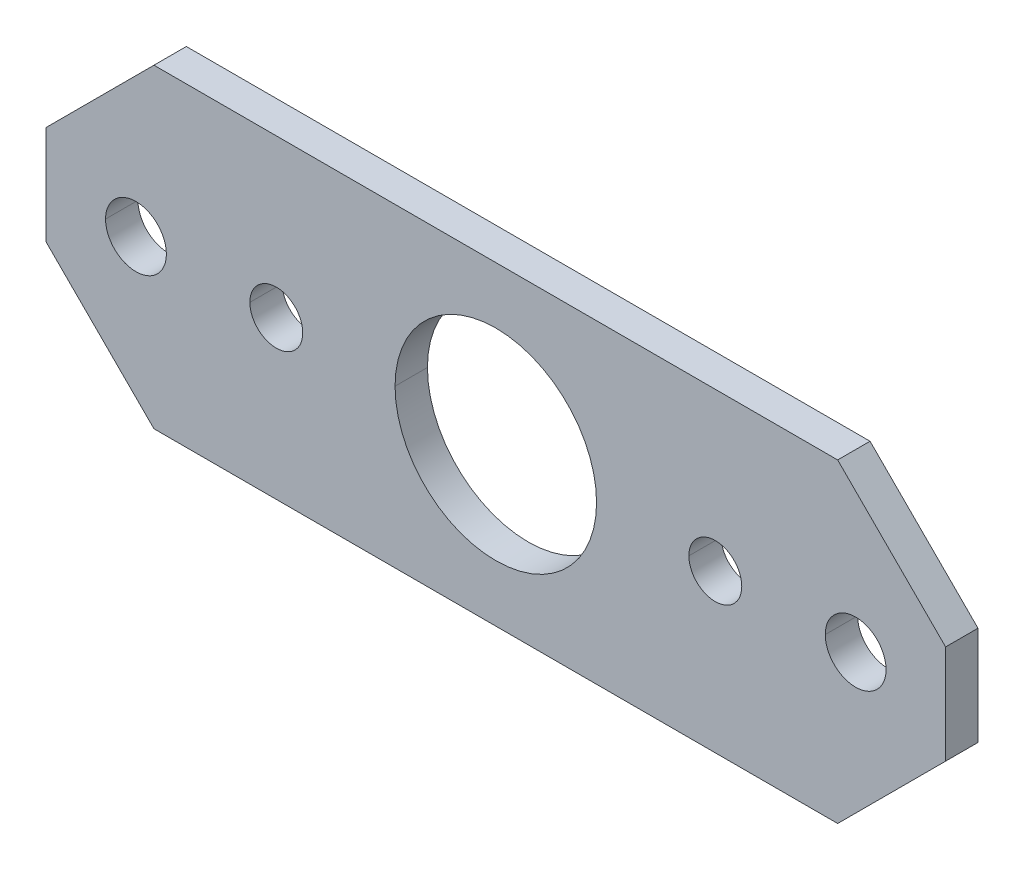
ISO-10303-21;
HEADER;
FILE_DESCRIPTION(('STEP AP214'),'2;1');
FILE_NAME('part.step','',(''),(''),'','','');
FILE_SCHEMA(('AUTOMOTIVE_DESIGN { 1 0 10303 214 1 1 1 1 }'));
ENDSEC;
DATA;
#1=APPLICATION_CONTEXT('core data for automotive mechanical design processes');
#2=APPLICATION_PROTOCOL_DEFINITION('international standard','automotive_design',2000,#1);
#3=PRODUCT_CONTEXT('',#1,'mechanical');
#4=PRODUCT('Part','Part','',(#3));
#5=PRODUCT_RELATED_PRODUCT_CATEGORY('part','',(#4));
#6=PRODUCT_DEFINITION_FORMATION('','',#4);
#7=PRODUCT_DEFINITION_CONTEXT('part definition',#1,'design');
#8=PRODUCT_DEFINITION('design','',#6,#7);
#9=PRODUCT_DEFINITION_SHAPE('','',#8);
#10=(LENGTH_UNIT() NAMED_UNIT(*) SI_UNIT(.MILLI.,.METRE.));
#11=(NAMED_UNIT(*) PLANE_ANGLE_UNIT() SI_UNIT($,.RADIAN.));
#12=(NAMED_UNIT(*) SI_UNIT($,.STERADIAN.) SOLID_ANGLE_UNIT());
#13=UNCERTAINTY_MEASURE_WITH_UNIT(LENGTH_MEASURE(1.E-05),#10,'distance_accuracy_value','');
#14=(GEOMETRIC_REPRESENTATION_CONTEXT(3) GLOBAL_UNCERTAINTY_ASSIGNED_CONTEXT((#13)) GLOBAL_UNIT_ASSIGNED_CONTEXT((#10,
#11,#12)) REPRESENTATION_CONTEXT('',''));
#15=CARTESIAN_POINT('',(0.,0.,0.));
#16=DIRECTION('',(0.,0.,1.));
#17=DIRECTION('',(1.,0.,0.));
#18=AXIS2_PLACEMENT_3D('',#15,#16,#17);
#19=CARTESIAN_POINT('',(-15.494,0.,2.286));
#20=DIRECTION('',(0.,0.,-1.));
#21=DIRECTION('',(-1.,0.,0.));
#22=AXIS2_PLACEMENT_3D('',#19,#20,#21);
#23=CYLINDRICAL_SURFACE('',#22,1.8669);
#24=CARTESIAN_POINT('',(-15.494,0.,2.286));
#25=DIRECTION('',(0.,0.,-1.));
#26=DIRECTION('',(-1.,0.,0.));
#27=AXIS2_PLACEMENT_3D('',#24,#25,#26);
#28=CIRCLE('',#27,1.8669);
#29=CARTESIAN_POINT('',(-13.6271,0.,2.286));
#30=VERTEX_POINT('',#29);
#31=CARTESIAN_POINT('',(-17.3609,0.,2.286));
#32=VERTEX_POINT('',#31);
#33=EDGE_CURVE('E40',#30,#32,#28,.T.);
#34=ORIENTED_EDGE('',*,*,#33,.F.);
#35=DIRECTION('',(0.,0.,-1.));
#36=VECTOR('',#35,1.);
#37=CARTESIAN_POINT('',(-13.6271,0.,2.286));
#38=LINE('',#37,#36);
#39=CARTESIAN_POINT('',(-13.6271,0.,0.));
#40=VERTEX_POINT('',#39);
#41=EDGE_CURVE('E11',#30,#40,#38,.T.);
#42=ORIENTED_EDGE('',*,*,#41,.T.);
#43=CARTESIAN_POINT('',(-15.494,0.,0.));
#44=DIRECTION('',(0.,0.,-1.));
#45=DIRECTION('',(-1.,0.,0.));
#46=AXIS2_PLACEMENT_3D('',#43,#44,#45);
#47=CIRCLE('',#46,1.8669);
#48=CARTESIAN_POINT('',(-17.3609,0.,0.));
#49=VERTEX_POINT('',#48);
#50=EDGE_CURVE('E27',#40,#49,#47,.T.);
#51=ORIENTED_EDGE('',*,*,#50,.T.);
#52=DIRECTION('',(0.,0.,-1.));
#53=VECTOR('',#52,1.);
#54=CARTESIAN_POINT('',(-17.3609,0.,2.286));
#55=LINE('',#54,#53);
#56=EDGE_CURVE('E20',#32,#49,#55,.T.);
#57=ORIENTED_EDGE('',*,*,#56,.F.);
#58=EDGE_LOOP('',(#34,#42,#51,#57));
#59=FACE_BOUND('',#58,.T.);
#60=ADVANCED_FACE('F16',(#59),#23,.F.);
#61=CARTESIAN_POINT('',(15.494,0.,2.286));
#62=DIRECTION('',(0.,0.,-1.));
#63=DIRECTION('',(-1.,0.,0.));
#64=AXIS2_PLACEMENT_3D('',#61,#62,#63);
#65=CYLINDRICAL_SURFACE('',#64,1.8669);
#66=CARTESIAN_POINT('',(15.494,0.,2.286));
#67=DIRECTION('',(0.,0.,-1.));
#68=DIRECTION('',(-1.,0.,0.));
#69=AXIS2_PLACEMENT_3D('',#66,#67,#68);
#70=CIRCLE('',#69,1.8669);
#71=CARTESIAN_POINT('',(17.3609,0.,2.286));
#72=VERTEX_POINT('',#71);
#73=CARTESIAN_POINT('',(13.6271,0.,2.286));
#74=VERTEX_POINT('',#73);
#75=EDGE_CURVE('E206',#72,#74,#70,.T.);
#76=ORIENTED_EDGE('',*,*,#75,.F.);
#77=DIRECTION('',(0.,0.,-1.));
#78=VECTOR('',#77,1.);
#79=CARTESIAN_POINT('',(17.3609,0.,2.286));
#80=LINE('',#79,#78);
#81=CARTESIAN_POINT('',(17.3609,0.,0.));
#82=VERTEX_POINT('',#81);
#83=EDGE_CURVE('E321',#72,#82,#80,.T.);
#84=ORIENTED_EDGE('',*,*,#83,.T.);
#85=CARTESIAN_POINT('',(15.494,0.,0.));
#86=DIRECTION('',(0.,0.,-1.));
#87=DIRECTION('',(-1.,0.,0.));
#88=AXIS2_PLACEMENT_3D('',#85,#86,#87);
#89=CIRCLE('',#88,1.8669);
#90=CARTESIAN_POINT('',(13.6271,0.,0.));
#91=VERTEX_POINT('',#90);
#92=EDGE_CURVE('E200',#82,#91,#89,.T.);
#93=ORIENTED_EDGE('',*,*,#92,.T.);
#94=DIRECTION('',(0.,0.,-1.));
#95=VECTOR('',#94,1.);
#96=CARTESIAN_POINT('',(13.6271,0.,2.286));
#97=LINE('',#96,#95);
#98=EDGE_CURVE('E356',#74,#91,#97,.T.);
#99=ORIENTED_EDGE('',*,*,#98,.F.);
#100=EDGE_LOOP('',(#76,#84,#93,#99));
#101=FACE_BOUND('',#100,.T.);
#102=ADVANCED_FACE('F429',(#101),#65,.F.);
#103=CARTESIAN_POINT('',(-25.4,0.,2.286));
#104=DIRECTION('',(0.,0.,-1.));
#105=DIRECTION('',(-1.,0.,0.));
#106=AXIS2_PLACEMENT_3D('',#103,#104,#105);
#107=CYLINDRICAL_SURFACE('',#106,2.1463);
#108=CARTESIAN_POINT('',(-25.4,0.,2.286));
#109=DIRECTION('',(0.,0.,-1.));
#110=DIRECTION('',(-1.,0.,0.));
#111=AXIS2_PLACEMENT_3D('',#108,#109,#110);
#112=CIRCLE('',#111,2.1463);
#113=CARTESIAN_POINT('',(-23.2537,0.,2.286));
#114=VERTEX_POINT('',#113);
#115=CARTESIAN_POINT('',(-27.5463,0.,2.286));
#116=VERTEX_POINT('',#115);
#117=EDGE_CURVE('E181',#114,#116,#112,.T.);
#118=ORIENTED_EDGE('',*,*,#117,.F.);
#119=DIRECTION('',(0.,0.,-1.));
#120=VECTOR('',#119,1.);
#121=CARTESIAN_POINT('',(-23.2537,0.,2.286));
#122=LINE('',#121,#120);
#123=CARTESIAN_POINT('',(-23.2537,0.,0.));
#124=VERTEX_POINT('',#123);
#125=EDGE_CURVE('E185',#114,#124,#122,.T.);
#126=ORIENTED_EDGE('',*,*,#125,.T.);
#127=CARTESIAN_POINT('',(-25.4,0.,0.));
#128=DIRECTION('',(0.,0.,-1.));
#129=DIRECTION('',(-1.,0.,0.));
#130=AXIS2_PLACEMENT_3D('',#127,#128,#129);
#131=CIRCLE('',#130,2.1463);
#132=CARTESIAN_POINT('',(-27.5463,0.,0.));
#133=VERTEX_POINT('',#132);
#134=EDGE_CURVE('E201',#124,#133,#131,.T.);
#135=ORIENTED_EDGE('',*,*,#134,.T.);
#136=DIRECTION('',(0.,0.,-1.));
#137=VECTOR('',#136,1.);
#138=CARTESIAN_POINT('',(-27.5463,0.,2.286));
#139=LINE('',#138,#137);
#140=EDGE_CURVE('E187',#116,#133,#139,.T.);
#141=ORIENTED_EDGE('',*,*,#140,.F.);
#142=EDGE_LOOP('',(#118,#126,#135,#141));
#143=FACE_BOUND('',#142,.T.);
#144=ADVANCED_FACE('F183',(#143),#107,.F.);
#145=CARTESIAN_POINT('',(25.4,0.,2.286));
#146=DIRECTION('',(0.,0.,-1.));
#147=DIRECTION('',(-1.,0.,0.));
#148=AXIS2_PLACEMENT_3D('',#145,#146,#147);
#149=CYLINDRICAL_SURFACE('',#148,2.1463);
#150=CARTESIAN_POINT('',(25.4,0.,2.286));
#151=DIRECTION('',(0.,0.,-1.));
#152=DIRECTION('',(-1.,0.,0.));
#153=AXIS2_PLACEMENT_3D('',#150,#151,#152);
#154=CIRCLE('',#153,2.1463);
#155=CARTESIAN_POINT('',(27.5463,0.,2.286));
#156=VERTEX_POINT('',#155);
#157=CARTESIAN_POINT('',(23.2537,0.,2.286));
#158=VERTEX_POINT('',#157);
#159=EDGE_CURVE('E334',#156,#158,#154,.T.);
#160=ORIENTED_EDGE('',*,*,#159,.F.);
#161=DIRECTION('',(0.,0.,-1.));
#162=VECTOR('',#161,1.);
#163=CARTESIAN_POINT('',(27.5463,0.,2.286));
#164=LINE('',#163,#162);
#165=CARTESIAN_POINT('',(27.5463,0.,0.));
#166=VERTEX_POINT('',#165);
#167=EDGE_CURVE('E296',#156,#166,#164,.T.);
#168=ORIENTED_EDGE('',*,*,#167,.T.);
#169=CARTESIAN_POINT('',(25.4,0.,0.));
#170=DIRECTION('',(0.,0.,-1.));
#171=DIRECTION('',(-1.,0.,0.));
#172=AXIS2_PLACEMENT_3D('',#169,#170,#171);
#173=CIRCLE('',#172,2.1463);
#174=CARTESIAN_POINT('',(23.2537,0.,0.));
#175=VERTEX_POINT('',#174);
#176=EDGE_CURVE('E241',#166,#175,#173,.T.);
#177=ORIENTED_EDGE('',*,*,#176,.T.);
#178=DIRECTION('',(0.,0.,-1.));
#179=VECTOR('',#178,1.);
#180=CARTESIAN_POINT('',(23.2537,0.,2.286));
#181=LINE('',#180,#179);
#182=EDGE_CURVE('E285',#158,#175,#181,.T.);
#183=ORIENTED_EDGE('',*,*,#182,.F.);
#184=EDGE_LOOP('',(#160,#168,#177,#183));
#185=FACE_BOUND('',#184,.T.);
#186=ADVANCED_FACE('F437',(#185),#149,.F.);
#187=CARTESIAN_POINT('',(0.,0.,2.286));
#188=DIRECTION('',(0.,0.,-1.));
#189=DIRECTION('',(-1.,0.,0.));
#190=AXIS2_PLACEMENT_3D('',#187,#188,#189);
#191=CYLINDRICAL_SURFACE('',#190,7.112);
#192=CARTESIAN_POINT('',(0.,0.,2.286));
#193=DIRECTION('',(0.,0.,-1.));
#194=DIRECTION('',(-1.,0.,0.));
#195=AXIS2_PLACEMENT_3D('',#192,#193,#194);
#196=CIRCLE('',#195,7.112);
#197=CARTESIAN_POINT('',(7.112,0.,2.286));
#198=VERTEX_POINT('',#197);
#199=CARTESIAN_POINT('',(-7.112,0.,2.286));
#200=VERTEX_POINT('',#199);
#201=EDGE_CURVE('E335',#198,#200,#196,.T.);
#202=ORIENTED_EDGE('',*,*,#201,.F.);
#203=DIRECTION('',(0.,0.,-1.));
#204=VECTOR('',#203,1.);
#205=CARTESIAN_POINT('',(7.112,0.,2.286));
#206=LINE('',#205,#204);
#207=CARTESIAN_POINT('',(7.112,0.,0.));
#208=VERTEX_POINT('',#207);
#209=EDGE_CURVE('E233',#198,#208,#206,.T.);
#210=ORIENTED_EDGE('',*,*,#209,.T.);
#211=CARTESIAN_POINT('',(0.,0.,0.));
#212=DIRECTION('',(0.,0.,-1.));
#213=DIRECTION('',(-1.,0.,0.));
#214=AXIS2_PLACEMENT_3D('',#211,#212,#213);
#215=CIRCLE('',#214,7.112);
#216=CARTESIAN_POINT('',(-7.112,0.,0.));
#217=VERTEX_POINT('',#216);
#218=EDGE_CURVE('E230',#208,#217,#215,.T.);
#219=ORIENTED_EDGE('',*,*,#218,.T.);
#220=DIRECTION('',(0.,0.,-1.));
#221=VECTOR('',#220,1.);
#222=CARTESIAN_POINT('',(-7.112,0.,2.286));
#223=LINE('',#222,#221);
#224=EDGE_CURVE('E286',#200,#217,#223,.T.);
#225=ORIENTED_EDGE('',*,*,#224,.F.);
#226=EDGE_LOOP('',(#202,#210,#219,#225));
#227=FACE_BOUND('',#226,.T.);
#228=ADVANCED_FACE('F409',(#227),#191,.F.);
#229=CARTESIAN_POINT('',(-31.75,11.1125,2.286));
#230=DIRECTION('',(1.,0.,0.));
#231=DIRECTION('',(0.,1.,0.));
#232=AXIS2_PLACEMENT_3D('',#229,#230,#231);
#233=PLANE('',#232);
#234=DIRECTION('',(0.,-1.,0.));
#235=VECTOR('',#234,1.);
#236=CARTESIAN_POINT('',(-31.75,11.1125,0.));
#237=LINE('',#236,#235);
#238=CARTESIAN_POINT('',(-31.75,3.4925,0.));
#239=VERTEX_POINT('',#238);
#240=CARTESIAN_POINT('',(-31.75,-3.4925,0.));
#241=VERTEX_POINT('',#240);
#242=EDGE_CURVE('E223',#239,#241,#237,.T.);
#243=ORIENTED_EDGE('',*,*,#242,.T.);
#244=DIRECTION('',(0.,0.,1.));
#245=VECTOR('',#244,1.);
#246=CARTESIAN_POINT('',(-31.75,-3.4925,2.286));
#247=LINE('',#246,#245);
#248=CARTESIAN_POINT('',(-31.75,-3.4925,2.286));
#249=VERTEX_POINT('',#248);
#250=EDGE_CURVE('E220',#241,#249,#247,.T.);
#251=ORIENTED_EDGE('',*,*,#250,.T.);
#252=DIRECTION('',(0.,-1.,0.));
#253=VECTOR('',#252,1.);
#254=CARTESIAN_POINT('',(-31.75,11.1125,2.286));
#255=LINE('',#254,#253);
#256=CARTESIAN_POINT('',(-31.75,3.4925,2.286));
#257=VERTEX_POINT('',#256);
#258=EDGE_CURVE('E228',#257,#249,#255,.T.);
#259=ORIENTED_EDGE('',*,*,#258,.F.);
#260=DIRECTION('',(0.,0.,-1.));
#261=VECTOR('',#260,1.);
#262=CARTESIAN_POINT('',(-31.75,3.4925,2.286));
#263=LINE('',#262,#261);
#264=EDGE_CURVE('E224',#257,#239,#263,.T.);
#265=ORIENTED_EDGE('',*,*,#264,.T.);
#266=EDGE_LOOP('',(#243,#251,#259,#265));
#267=FACE_BOUND('',#266,.T.);
#268=ADVANCED_FACE('F564',(#267),#233,.F.);
#269=CARTESIAN_POINT('',(-31.75,-11.1125,2.286));
#270=DIRECTION('',(0.,1.,0.));
#271=DIRECTION('',(1.,0.,0.));
#272=AXIS2_PLACEMENT_3D('',#269,#270,#271);
#273=PLANE('',#272);
#274=DIRECTION('',(1.,0.,0.));
#275=VECTOR('',#274,1.);
#276=CARTESIAN_POINT('',(-31.75,-11.1125,2.286));
#277=LINE('',#276,#275);
#278=CARTESIAN_POINT('',(-24.13,-11.1125,2.286));
#279=VERTEX_POINT('',#278);
#280=CARTESIAN_POINT('',(24.13,-11.1125,2.286));
#281=VERTEX_POINT('',#280);
#282=EDGE_CURVE('E229',#279,#281,#277,.T.);
#283=ORIENTED_EDGE('',*,*,#282,.F.);
#284=DIRECTION('',(0.,0.,-1.));
#285=VECTOR('',#284,1.);
#286=CARTESIAN_POINT('',(-24.13,-11.1125,2.286));
#287=LINE('',#286,#285);
#288=CARTESIAN_POINT('',(-24.13,-11.1125,0.));
#289=VERTEX_POINT('',#288);
#290=EDGE_CURVE('E322',#279,#289,#287,.T.);
#291=ORIENTED_EDGE('',*,*,#290,.T.);
#292=DIRECTION('',(1.,0.,0.));
#293=VECTOR('',#292,1.);
#294=CARTESIAN_POINT('',(-31.75,-11.1125,0.));
#295=LINE('',#294,#293);
#296=CARTESIAN_POINT('',(24.13,-11.1125,0.));
#297=VERTEX_POINT('',#296);
#298=EDGE_CURVE('E326',#289,#297,#295,.T.);
#299=ORIENTED_EDGE('',*,*,#298,.T.);
#300=DIRECTION('',(0.,0.,1.));
#301=VECTOR('',#300,1.);
#302=CARTESIAN_POINT('',(24.13,-11.1125,2.286));
#303=LINE('',#302,#301);
#304=EDGE_CURVE('E275',#297,#281,#303,.T.);
#305=ORIENTED_EDGE('',*,*,#304,.T.);
#306=EDGE_LOOP('',(#283,#291,#299,#305));
#307=FACE_BOUND('',#306,.T.);
#308=ADVANCED_FACE('F479',(#307),#273,.F.);
#309=CARTESIAN_POINT('',(31.75,11.1125,2.286));
#310=DIRECTION('',(-1.,0.,0.));
#311=DIRECTION('',(0.,0.,1.));
#312=AXIS2_PLACEMENT_3D('',#309,#310,#311);
#313=PLANE('',#312);
#314=DIRECTION('',(0.,1.,0.));
#315=VECTOR('',#314,1.);
#316=CARTESIAN_POINT('',(31.75,11.1125,2.286));
#317=LINE('',#316,#315);
#318=CARTESIAN_POINT('',(31.75,-3.4925,2.286));
#319=VERTEX_POINT('',#318);
#320=CARTESIAN_POINT('',(31.75,3.4925,2.286));
#321=VERTEX_POINT('',#320);
#322=EDGE_CURVE('E266',#319,#321,#317,.T.);
#323=ORIENTED_EDGE('',*,*,#322,.F.);
#324=DIRECTION('',(0.,0.,-1.));
#325=VECTOR('',#324,1.);
#326=CARTESIAN_POINT('',(31.75,-3.4925,2.286));
#327=LINE('',#326,#325);
#328=CARTESIAN_POINT('',(31.75,-3.4925,0.));
#329=VERTEX_POINT('',#328);
#330=EDGE_CURVE('E271',#319,#329,#327,.T.);
#331=ORIENTED_EDGE('',*,*,#330,.T.);
#332=DIRECTION('',(0.,1.,0.));
#333=VECTOR('',#332,1.);
#334=CARTESIAN_POINT('',(31.75,11.1125,0.));
#335=LINE('',#334,#333);
#336=CARTESIAN_POINT('',(31.75,3.4925,0.));
#337=VERTEX_POINT('',#336);
#338=EDGE_CURVE('E218',#329,#337,#335,.T.);
#339=ORIENTED_EDGE('',*,*,#338,.T.);
#340=DIRECTION('',(0.,0.,1.));
#341=VECTOR('',#340,1.);
#342=CARTESIAN_POINT('',(31.75,3.4925,2.286));
#343=LINE('',#342,#341);
#344=EDGE_CURVE('E258',#337,#321,#343,.T.);
#345=ORIENTED_EDGE('',*,*,#344,.T.);
#346=EDGE_LOOP('',(#323,#331,#339,#345));
#347=FACE_BOUND('',#346,.T.);
#348=ADVANCED_FACE('F422',(#347),#313,.F.);
#349=CARTESIAN_POINT('',(-31.75,11.1125,2.286));
#350=DIRECTION('',(0.,-1.,0.));
#351=DIRECTION('',(0.,0.,-1.));
#352=AXIS2_PLACEMENT_3D('',#349,#350,#351);
#353=PLANE('',#352);
#354=DIRECTION('',(-1.,0.,0.));
#355=VECTOR('',#354,1.);
#356=CARTESIAN_POINT('',(-31.75,11.1125,2.286));
#357=LINE('',#356,#355);
#358=CARTESIAN_POINT('',(24.13,11.1125,2.286));
#359=VERTEX_POINT('',#358);
#360=CARTESIAN_POINT('',(-24.13,11.1125,2.286));
#361=VERTEX_POINT('',#360);
#362=EDGE_CURVE('E280',#359,#361,#357,.T.);
#363=ORIENTED_EDGE('',*,*,#362,.F.);
#364=DIRECTION('',(0.,0.,-1.));
#365=VECTOR('',#364,1.);
#366=CARTESIAN_POINT('',(24.13,11.1125,2.286));
#367=LINE('',#366,#365);
#368=CARTESIAN_POINT('',(24.13,11.1125,0.));
#369=VERTEX_POINT('',#368);
#370=EDGE_CURVE('E261',#359,#369,#367,.T.);
#371=ORIENTED_EDGE('',*,*,#370,.T.);
#372=DIRECTION('',(-1.,0.,0.));
#373=VECTOR('',#372,1.);
#374=CARTESIAN_POINT('',(-31.75,11.1125,0.));
#375=LINE('',#374,#373);
#376=CARTESIAN_POINT('',(-24.13,11.1125,0.));
#377=VERTEX_POINT('',#376);
#378=EDGE_CURVE('E339',#369,#377,#375,.T.);
#379=ORIENTED_EDGE('',*,*,#378,.T.);
#380=DIRECTION('',(0.,0.,1.));
#381=VECTOR('',#380,1.);
#382=CARTESIAN_POINT('',(-24.13,11.1125,2.286));
#383=LINE('',#382,#381);
#384=EDGE_CURVE('E350',#377,#361,#383,.T.);
#385=ORIENTED_EDGE('',*,*,#384,.T.);
#386=EDGE_LOOP('',(#363,#371,#379,#385));
#387=FACE_BOUND('',#386,.T.);
#388=ADVANCED_FACE('F412',(#387),#353,.F.);
#389=CARTESIAN_POINT('',(-31.75,-11.1125,2.286));
#390=DIRECTION('',(0.,0.,1.));
#391=DIRECTION('',(1.,0.,0.));
#392=AXIS2_PLACEMENT_3D('',#389,#390,#391);
#393=PLANE('',#392);
#394=ORIENTED_EDGE('',*,*,#258,.T.);
#395=DIRECTION('',(0.707106781186548,-0.707106781186548,0.));
#396=VECTOR('',#395,1.);
#397=CARTESIAN_POINT('',(-27.94,-7.3025,2.286));
#398=LINE('',#397,#396);
#399=EDGE_CURVE('E225',#249,#279,#398,.T.);
#400=ORIENTED_EDGE('',*,*,#399,.T.);
#401=ORIENTED_EDGE('',*,*,#282,.T.);
#402=DIRECTION('',(0.707106781186548,0.707106781186547,0.));
#403=VECTOR('',#402,1.);
#404=CARTESIAN_POINT('',(-3.81,-39.0525,2.286));
#405=LINE('',#404,#403);
#406=EDGE_CURVE('E262',#281,#319,#405,.T.);
#407=ORIENTED_EDGE('',*,*,#406,.T.);
#408=ORIENTED_EDGE('',*,*,#322,.T.);
#409=DIRECTION('',(-0.707106781186548,0.707106781186548,0.));
#410=VECTOR('',#409,1.);
#411=CARTESIAN_POINT('',(7.3025,27.94,2.286));
#412=LINE('',#411,#410);
#413=EDGE_CURVE('E276',#321,#359,#412,.T.);
#414=ORIENTED_EDGE('',*,*,#413,.T.);
#415=ORIENTED_EDGE('',*,*,#362,.T.);
#416=DIRECTION('',(-0.707106781186548,-0.707106781186548,0.));
#417=VECTOR('',#416,1.);
#418=CARTESIAN_POINT('',(-39.0525,-3.81,2.286));
#419=LINE('',#418,#417);
#420=EDGE_CURVE('E342',#361,#257,#419,.T.);
#421=ORIENTED_EDGE('',*,*,#420,.T.);
#422=EDGE_LOOP('',(#394,#400,#401,#407,#408,#414,#415,#421));
#423=FACE_BOUND('',#422,.T.);
#424=CARTESIAN_POINT('',(-15.494,0.,2.286));
#425=DIRECTION('',(0.,0.,-1.));
#426=DIRECTION('',(-1.,0.,0.));
#427=AXIS2_PLACEMENT_3D('',#424,#425,#426);
#428=CIRCLE('',#427,1.8669);
#429=EDGE_CURVE('E386',#32,#30,#428,.T.);
#430=ORIENTED_EDGE('',*,*,#429,.T.);
#431=ORIENTED_EDGE('',*,*,#33,.T.);
#432=EDGE_LOOP('',(#430,#431));
#433=FACE_BOUND('',#432,.T.);
#434=CARTESIAN_POINT('',(15.494,0.,2.286));
#435=DIRECTION('',(0.,0.,-1.));
#436=DIRECTION('',(-1.,0.,0.));
#437=AXIS2_PLACEMENT_3D('',#434,#435,#436);
#438=CIRCLE('',#437,1.8669);
#439=EDGE_CURVE('E214',#74,#72,#438,.T.);
#440=ORIENTED_EDGE('',*,*,#439,.T.);
#441=ORIENTED_EDGE('',*,*,#75,.T.);
#442=EDGE_LOOP('',(#440,#441));
#443=FACE_BOUND('',#442,.T.);
#444=CARTESIAN_POINT('',(-25.4,0.,2.286));
#445=DIRECTION('',(0.,0.,-1.));
#446=DIRECTION('',(-1.,0.,0.));
#447=AXIS2_PLACEMENT_3D('',#444,#445,#446);
#448=CIRCLE('',#447,2.1463);
#449=EDGE_CURVE('E192',#116,#114,#448,.T.);
#450=ORIENTED_EDGE('',*,*,#449,.T.);
#451=ORIENTED_EDGE('',*,*,#117,.T.);
#452=EDGE_LOOP('',(#450,#451));
#453=FACE_BOUND('',#452,.T.);
#454=CARTESIAN_POINT('',(25.4,0.,2.286));
#455=DIRECTION('',(0.,0.,-1.));
#456=DIRECTION('',(-1.,0.,0.));
#457=AXIS2_PLACEMENT_3D('',#454,#455,#456);
#458=CIRCLE('',#457,2.1463);
#459=EDGE_CURVE('E193',#158,#156,#458,.T.);
#460=ORIENTED_EDGE('',*,*,#459,.T.);
#461=ORIENTED_EDGE('',*,*,#159,.T.);
#462=EDGE_LOOP('',(#460,#461));
#463=FACE_BOUND('',#462,.T.);
#464=CARTESIAN_POINT('',(0.,0.,2.286));
#465=DIRECTION('',(0.,0.,-1.));
#466=DIRECTION('',(-1.,0.,0.));
#467=AXIS2_PLACEMENT_3D('',#464,#465,#466);
#468=CIRCLE('',#467,7.112);
#469=EDGE_CURVE('E330',#200,#198,#468,.T.);
#470=ORIENTED_EDGE('',*,*,#469,.T.);
#471=ORIENTED_EDGE('',*,*,#201,.T.);
#472=EDGE_LOOP('',(#470,#471));
#473=FACE_BOUND('',#472,.T.);
#474=ADVANCED_FACE('F203',(#423,#433,#443,#453,#463,#473),#393,.T.);
#475=CARTESIAN_POINT('',(-31.75,-11.1125,0.));
#476=DIRECTION('',(0.,0.,1.));
#477=DIRECTION('',(1.,0.,0.));
#478=AXIS2_PLACEMENT_3D('',#475,#476,#477);
#479=PLANE('',#478);
#480=ORIENTED_EDGE('',*,*,#298,.F.);
#481=DIRECTION('',(-0.707106781186548,0.707106781186548,0.));
#482=VECTOR('',#481,1.);
#483=CARTESIAN_POINT('',(-24.13,-11.1125,0.));
#484=LINE('',#483,#482);
#485=EDGE_CURVE('E293',#289,#241,#484,.T.);
#486=ORIENTED_EDGE('',*,*,#485,.T.);
#487=ORIENTED_EDGE('',*,*,#242,.F.);
#488=DIRECTION('',(0.707106781186548,0.707106781186548,0.));
#489=VECTOR('',#488,1.);
#490=CARTESIAN_POINT('',(-31.75,3.4925,0.));
#491=LINE('',#490,#489);
#492=EDGE_CURVE('E290',#239,#377,#491,.T.);
#493=ORIENTED_EDGE('',*,*,#492,.T.);
#494=ORIENTED_EDGE('',*,*,#378,.F.);
#495=DIRECTION('',(0.707106781186548,-0.707106781186548,0.));
#496=VECTOR('',#495,1.);
#497=CARTESIAN_POINT('',(24.13,11.1125,0.));
#498=LINE('',#497,#496);
#499=EDGE_CURVE('E294',#369,#337,#498,.T.);
#500=ORIENTED_EDGE('',*,*,#499,.T.);
#501=ORIENTED_EDGE('',*,*,#338,.F.);
#502=DIRECTION('',(-0.707106781186548,-0.707106781186547,0.));
#503=VECTOR('',#502,1.);
#504=CARTESIAN_POINT('',(31.75,-3.4925,0.));
#505=LINE('',#504,#503);
#506=EDGE_CURVE('E289',#329,#297,#505,.T.);
#507=ORIENTED_EDGE('',*,*,#506,.T.);
#508=EDGE_LOOP('',(#480,#486,#487,#493,#494,#500,#501,#507));
#509=FACE_BOUND('',#508,.T.);
#510=CARTESIAN_POINT('',(-15.494,0.,0.));
#511=DIRECTION('',(0.,0.,-1.));
#512=DIRECTION('',(-1.,0.,0.));
#513=AXIS2_PLACEMENT_3D('',#510,#511,#512);
#514=CIRCLE('',#513,1.8669);
#515=EDGE_CURVE('E267',#49,#40,#514,.T.);
#516=ORIENTED_EDGE('',*,*,#515,.F.);
#517=ORIENTED_EDGE('',*,*,#50,.F.);
#518=EDGE_LOOP('',(#516,#517));
#519=FACE_BOUND('',#518,.T.);
#520=CARTESIAN_POINT('',(15.494,0.,0.));
#521=DIRECTION('',(0.,0.,-1.));
#522=DIRECTION('',(-1.,0.,0.));
#523=AXIS2_PLACEMENT_3D('',#520,#521,#522);
#524=CIRCLE('',#523,1.8669);
#525=EDGE_CURVE('E358',#91,#82,#524,.T.);
#526=ORIENTED_EDGE('',*,*,#525,.F.);
#527=ORIENTED_EDGE('',*,*,#92,.F.);
#528=EDGE_LOOP('',(#526,#527));
#529=FACE_BOUND('',#528,.T.);
#530=CARTESIAN_POINT('',(-25.4,0.,0.));
#531=DIRECTION('',(0.,0.,-1.));
#532=DIRECTION('',(-1.,0.,0.));
#533=AXIS2_PLACEMENT_3D('',#530,#531,#532);
#534=CIRCLE('',#533,2.1463);
#535=EDGE_CURVE('E198',#133,#124,#534,.T.);
#536=ORIENTED_EDGE('',*,*,#535,.F.);
#537=ORIENTED_EDGE('',*,*,#134,.F.);
#538=EDGE_LOOP('',(#536,#537));
#539=FACE_BOUND('',#538,.T.);
#540=CARTESIAN_POINT('',(25.4,0.,0.));
#541=DIRECTION('',(0.,0.,-1.));
#542=DIRECTION('',(-1.,0.,0.));
#543=AXIS2_PLACEMENT_3D('',#540,#541,#542);
#544=CIRCLE('',#543,2.1463);
#545=EDGE_CURVE('E281',#175,#166,#544,.T.);
#546=ORIENTED_EDGE('',*,*,#545,.F.);
#547=ORIENTED_EDGE('',*,*,#176,.F.);
#548=EDGE_LOOP('',(#546,#547));
#549=FACE_BOUND('',#548,.T.);
#550=CARTESIAN_POINT('',(0.,0.,0.));
#551=DIRECTION('',(0.,0.,-1.));
#552=DIRECTION('',(-1.,0.,0.));
#553=AXIS2_PLACEMENT_3D('',#550,#551,#552);
#554=CIRCLE('',#553,7.112);
#555=EDGE_CURVE('E256',#217,#208,#554,.T.);
#556=ORIENTED_EDGE('',*,*,#555,.F.);
#557=ORIENTED_EDGE('',*,*,#218,.F.);
#558=EDGE_LOOP('',(#556,#557));
#559=FACE_BOUND('',#558,.T.);
#560=ADVANCED_FACE('F408',(#509,#519,#529,#539,#549,#559),#479,.F.);
#561=CARTESIAN_POINT('',(0.,0.,2.286));
#562=DIRECTION('',(0.,0.,-1.));
#563=DIRECTION('',(-1.,0.,0.));
#564=AXIS2_PLACEMENT_3D('',#561,#562,#563);
#565=CYLINDRICAL_SURFACE('',#564,7.112);
#566=ORIENTED_EDGE('',*,*,#209,.F.);
#567=ORIENTED_EDGE('',*,*,#469,.F.);
#568=ORIENTED_EDGE('',*,*,#224,.T.);
#569=ORIENTED_EDGE('',*,*,#555,.T.);
#570=EDGE_LOOP('',(#566,#567,#568,#569));
#571=FACE_BOUND('',#570,.T.);
#572=ADVANCED_FACE('F405',(#571),#565,.F.);
#573=CARTESIAN_POINT('',(25.4,0.,2.286));
#574=DIRECTION('',(0.,0.,-1.));
#575=DIRECTION('',(-1.,0.,0.));
#576=AXIS2_PLACEMENT_3D('',#573,#574,#575);
#577=CYLINDRICAL_SURFACE('',#576,2.1463);
#578=ORIENTED_EDGE('',*,*,#167,.F.);
#579=ORIENTED_EDGE('',*,*,#459,.F.);
#580=ORIENTED_EDGE('',*,*,#182,.T.);
#581=ORIENTED_EDGE('',*,*,#545,.T.);
#582=EDGE_LOOP('',(#578,#579,#580,#581));
#583=FACE_BOUND('',#582,.T.);
#584=ADVANCED_FACE('F18',(#583),#577,.F.);
#585=CARTESIAN_POINT('',(-25.4,0.,2.286));
#586=DIRECTION('',(0.,0.,-1.));
#587=DIRECTION('',(-1.,0.,0.));
#588=AXIS2_PLACEMENT_3D('',#585,#586,#587);
#589=CYLINDRICAL_SURFACE('',#588,2.1463);
#590=ORIENTED_EDGE('',*,*,#125,.F.);
#591=ORIENTED_EDGE('',*,*,#449,.F.);
#592=ORIENTED_EDGE('',*,*,#140,.T.);
#593=ORIENTED_EDGE('',*,*,#535,.T.);
#594=EDGE_LOOP('',(#590,#591,#592,#593));
#595=FACE_BOUND('',#594,.T.);
#596=ADVANCED_FACE('F196',(#595),#589,.F.);
#597=CARTESIAN_POINT('',(15.494,0.,2.286));
#598=DIRECTION('',(0.,0.,-1.));
#599=DIRECTION('',(-1.,0.,0.));
#600=AXIS2_PLACEMENT_3D('',#597,#598,#599);
#601=CYLINDRICAL_SURFACE('',#600,1.8669);
#602=ORIENTED_EDGE('',*,*,#83,.F.);
#603=ORIENTED_EDGE('',*,*,#439,.F.);
#604=ORIENTED_EDGE('',*,*,#98,.T.);
#605=ORIENTED_EDGE('',*,*,#525,.T.);
#606=EDGE_LOOP('',(#602,#603,#604,#605));
#607=FACE_BOUND('',#606,.T.);
#608=ADVANCED_FACE('F439',(#607),#601,.F.);
#609=CARTESIAN_POINT('',(-15.494,0.,2.286));
#610=DIRECTION('',(0.,0.,-1.));
#611=DIRECTION('',(-1.,0.,0.));
#612=AXIS2_PLACEMENT_3D('',#609,#610,#611);
#613=CYLINDRICAL_SURFACE('',#612,1.8669);
#614=ORIENTED_EDGE('',*,*,#41,.F.);
#615=ORIENTED_EDGE('',*,*,#429,.F.);
#616=ORIENTED_EDGE('',*,*,#56,.T.);
#617=ORIENTED_EDGE('',*,*,#515,.T.);
#618=EDGE_LOOP('',(#614,#615,#616,#617));
#619=FACE_BOUND('',#618,.T.);
#620=ADVANCED_FACE('F441',(#619),#613,.F.);
#621=CARTESIAN_POINT('',(-31.75,3.4925,2.286));
#622=DIRECTION('',(0.707106781186548,-0.707106781186548,0.));
#623=DIRECTION('',(0.,0.,-1.));
#624=AXIS2_PLACEMENT_3D('',#621,#622,#623);
#625=PLANE('',#624);
#626=ORIENTED_EDGE('',*,*,#420,.F.);
#627=ORIENTED_EDGE('',*,*,#384,.F.);
#628=ORIENTED_EDGE('',*,*,#492,.F.);
#629=ORIENTED_EDGE('',*,*,#264,.F.);
#630=EDGE_LOOP('',(#626,#627,#628,#629));
#631=FACE_BOUND('',#630,.T.);
#632=ADVANCED_FACE('F446',(#631),#625,.F.);
#633=CARTESIAN_POINT('',(24.13,11.1125,2.286));
#634=DIRECTION('',(-0.707106781186547,-0.707106781186548,0.));
#635=DIRECTION('',(-0.707106781186548,0.707106781186547,0.));
#636=AXIS2_PLACEMENT_3D('',#633,#634,#635);
#637=PLANE('',#636);
#638=ORIENTED_EDGE('',*,*,#413,.F.);
#639=ORIENTED_EDGE('',*,*,#344,.F.);
#640=ORIENTED_EDGE('',*,*,#499,.F.);
#641=ORIENTED_EDGE('',*,*,#370,.F.);
#642=EDGE_LOOP('',(#638,#639,#640,#641));
#643=FACE_BOUND('',#642,.T.);
#644=ADVANCED_FACE('F492',(#643),#637,.F.);
#645=CARTESIAN_POINT('',(31.75,-3.4925,2.286));
#646=DIRECTION('',(-0.707106781186547,0.707106781186548,0.));
#647=DIRECTION('',(0.,0.,1.));
#648=AXIS2_PLACEMENT_3D('',#645,#646,#647);
#649=PLANE('',#648);
#650=ORIENTED_EDGE('',*,*,#406,.F.);
#651=ORIENTED_EDGE('',*,*,#304,.F.);
#652=ORIENTED_EDGE('',*,*,#506,.F.);
#653=ORIENTED_EDGE('',*,*,#330,.F.);
#654=EDGE_LOOP('',(#650,#651,#652,#653));
#655=FACE_BOUND('',#654,.T.);
#656=ADVANCED_FACE('F477',(#655),#649,.F.);
#657=CARTESIAN_POINT('',(-24.13,-11.1125,2.286));
#658=DIRECTION('',(0.707106781186548,0.707106781186548,0.));
#659=DIRECTION('',(0.,0.,-1.));
#660=AXIS2_PLACEMENT_3D('',#657,#658,#659);
#661=PLANE('',#660);
#662=ORIENTED_EDGE('',*,*,#399,.F.);
#663=ORIENTED_EDGE('',*,*,#250,.F.);
#664=ORIENTED_EDGE('',*,*,#485,.F.);
#665=ORIENTED_EDGE('',*,*,#290,.F.);
#666=EDGE_LOOP('',(#662,#663,#664,#665));
#667=FACE_BOUND('',#666,.T.);
#668=ADVANCED_FACE('F484',(#667),#661,.F.);
#669=CLOSED_SHELL('',(#60,#102,#144,#186,#228,#268,#308,#348,#388,#474,#560,#572,#584,#596,#608,
#620,#632,#644,#656,#668));
#670=MANIFOLD_SOLID_BREP('B1',#669);
#671=ADVANCED_BREP_SHAPE_REPRESENTATION('',(#18,#670),#14);
#672=SHAPE_DEFINITION_REPRESENTATION(#9,#671);
ENDSEC;
END-ISO-10303-21;
